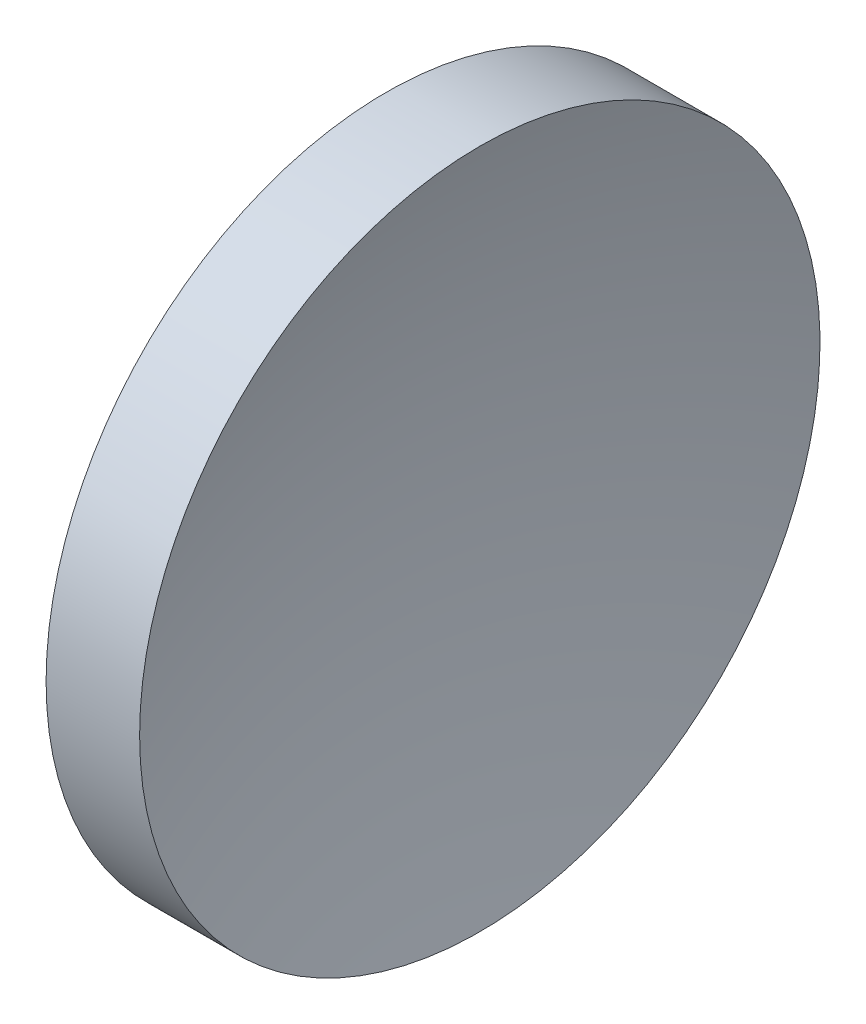
ISO-10303-21;
HEADER;
FILE_DESCRIPTION(('STEP AP214'),'2;1');
FILE_NAME('part.step','',(''),(''),'','','');
FILE_SCHEMA(('AUTOMOTIVE_DESIGN { 1 0 10303 214 1 1 1 1 }'));
ENDSEC;
DATA;
#1=APPLICATION_CONTEXT('core data for automotive mechanical design processes');
#2=APPLICATION_PROTOCOL_DEFINITION('international standard','automotive_design',2000,#1);
#3=PRODUCT_CONTEXT('',#1,'mechanical');
#4=PRODUCT('Part','Part','',(#3));
#5=PRODUCT_RELATED_PRODUCT_CATEGORY('part','',(#4));
#6=PRODUCT_DEFINITION_FORMATION('','',#4);
#7=PRODUCT_DEFINITION_CONTEXT('part definition',#1,'design');
#8=PRODUCT_DEFINITION('design','',#6,#7);
#9=PRODUCT_DEFINITION_SHAPE('','',#8);
#10=(LENGTH_UNIT() NAMED_UNIT(*) SI_UNIT(.MILLI.,.METRE.));
#11=(NAMED_UNIT(*) PLANE_ANGLE_UNIT() SI_UNIT($,.RADIAN.));
#12=(NAMED_UNIT(*) SI_UNIT($,.STERADIAN.) SOLID_ANGLE_UNIT());
#13=UNCERTAINTY_MEASURE_WITH_UNIT(LENGTH_MEASURE(1.E-05),#10,'distance_accuracy_value','');
#14=(GEOMETRIC_REPRESENTATION_CONTEXT(3) GLOBAL_UNCERTAINTY_ASSIGNED_CONTEXT((#13)) GLOBAL_UNIT_ASSIGNED_CONTEXT((#10,
#11,#12)) REPRESENTATION_CONTEXT('',''));
#15=CARTESIAN_POINT('',(0.,0.,0.));
#16=DIRECTION('',(0.,0.,1.));
#17=DIRECTION('',(1.,0.,0.));
#18=AXIS2_PLACEMENT_3D('',#15,#16,#17);
#19=CARTESIAN_POINT('',(199.359437134643,65.1556304570152,0.));
#20=DIRECTION('',(-1.,0.,0.));
#21=DIRECTION('',(0.,1.,0.));
#22=AXIS2_PLACEMENT_3D('',#19,#20,#21);
#23=SPHERICAL_SURFACE('',#22,82.62);
#24=CARTESIAN_POINT('',(120.612599737831,65.1556304570152,0.));
#25=DIRECTION('',(-1.,0.,0.));
#26=DIRECTION('',(0.,0.,1.));
#27=AXIS2_PLACEMENT_3D('',#24,#25,#26);
#28=CIRCLE('',#27,25.);
#29=CARTESIAN_POINT('',(120.612599737831,65.1556304570152,25.));
#30=VERTEX_POINT('',#29);
#31=EDGE_CURVE('E10',#30,#30,#28,.T.);
#32=ORIENTED_EDGE('',*,*,#31,.F.);
#33=EDGE_LOOP('',(#32));
#34=FACE_BOUND('',#33,.T.);
#35=ADVANCED_FACE('F35',(#34),#23,.F.);
#36=CARTESIAN_POINT('',(105.62183712383,65.1556304570152,0.));
#37=DIRECTION('',(-1.,0.,0.));
#38=DIRECTION('',(0.,0.,1.));
#39=AXIS2_PLACEMENT_3D('',#36,#37,#38);
#40=CYLINDRICAL_SURFACE('',#39,25.);
#41=CARTESIAN_POINT('',(113.739437134643,65.1556304570152,0.));
#42=DIRECTION('',(-1.,0.,0.));
#43=DIRECTION('',(0.,0.,1.));
#44=AXIS2_PLACEMENT_3D('',#41,#42,#43);
#45=CIRCLE('',#44,25.);
#46=CARTESIAN_POINT('',(113.739437134643,65.1556304570152,25.));
#47=VERTEX_POINT('',#46);
#48=EDGE_CURVE('E41',#47,#47,#45,.T.);
#49=ORIENTED_EDGE('',*,*,#48,.F.);
#50=EDGE_LOOP('',(#49));
#51=FACE_BOUND('',#50,.T.);
#52=ORIENTED_EDGE('',*,*,#31,.T.);
#53=EDGE_LOOP('',(#52));
#54=FACE_BOUND('',#53,.T.);
#55=ADVANCED_FACE('F49',(#51,#54),#40,.T.);
#56=CARTESIAN_POINT('',(113.739437134643,65.1556304570152,0.));
#57=DIRECTION('',(1.,0.,0.));
#58=DIRECTION('',(0.,0.,-1.));
#59=AXIS2_PLACEMENT_3D('',#56,#57,#58);
#60=PLANE('',#59);
#61=ORIENTED_EDGE('',*,*,#48,.T.);
#62=EDGE_LOOP('',(#61));
#63=FACE_BOUND('',#62,.T.);
#64=ADVANCED_FACE('F47',(#63),#60,.F.);
#65=CLOSED_SHELL('',(#35,#55,#64));
#66=MANIFOLD_SOLID_BREP('B2',#65);
#67=ADVANCED_BREP_SHAPE_REPRESENTATION('',(#18,#66),#14);
#68=SHAPE_DEFINITION_REPRESENTATION(#9,#67);
ENDSEC;
END-ISO-10303-21;
